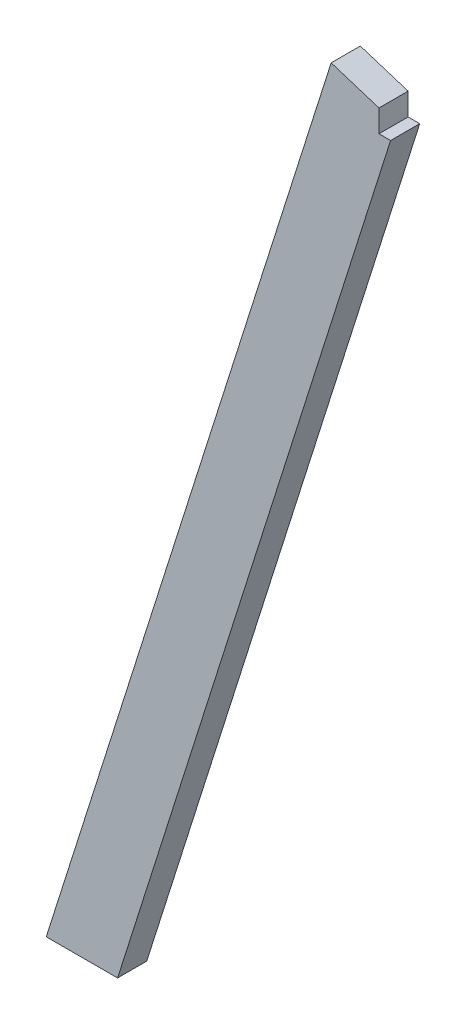
ISO-10303-21;
HEADER;
FILE_DESCRIPTION(('STEP AP214'),'2;1');
FILE_NAME('part.step','',(''),(''),'','','');
FILE_SCHEMA(('AUTOMOTIVE_DESIGN { 1 0 10303 214 1 1 1 1 }'));
ENDSEC;
DATA;
#1=APPLICATION_CONTEXT('core data for automotive mechanical design processes');
#2=APPLICATION_PROTOCOL_DEFINITION('international standard','automotive_design',2000,#1);
#3=PRODUCT_CONTEXT('',#1,'mechanical');
#4=PRODUCT('Part','Part','',(#3));
#5=PRODUCT_RELATED_PRODUCT_CATEGORY('part','',(#4));
#6=PRODUCT_DEFINITION_FORMATION('','',#4);
#7=PRODUCT_DEFINITION_CONTEXT('part definition',#1,'design');
#8=PRODUCT_DEFINITION('design','',#6,#7);
#9=PRODUCT_DEFINITION_SHAPE('','',#8);
#10=(LENGTH_UNIT() NAMED_UNIT(*) SI_UNIT(.MILLI.,.METRE.));
#11=(NAMED_UNIT(*) PLANE_ANGLE_UNIT() SI_UNIT($,.RADIAN.));
#12=(NAMED_UNIT(*) SI_UNIT($,.STERADIAN.) SOLID_ANGLE_UNIT());
#13=UNCERTAINTY_MEASURE_WITH_UNIT(LENGTH_MEASURE(1.E-05),#10,'distance_accuracy_value','');
#14=(GEOMETRIC_REPRESENTATION_CONTEXT(3) GLOBAL_UNCERTAINTY_ASSIGNED_CONTEXT((#13)) GLOBAL_UNIT_ASSIGNED_CONTEXT((#10,
#11,#12)) REPRESENTATION_CONTEXT('',''));
#15=CARTESIAN_POINT('',(0.,0.,0.));
#16=DIRECTION('',(0.,0.,1.));
#17=DIRECTION('',(1.,0.,0.));
#18=AXIS2_PLACEMENT_3D('',#15,#16,#17);
#19=CARTESIAN_POINT('',(0.,0.,38.1));
#20=DIRECTION('',(0.953307939110766,-0.301999955676131,0.));
#21=DIRECTION('',(0.301999955676131,0.953307939110765,0.));
#22=AXIS2_PLACEMENT_3D('',#19,#20,#21);
#23=PLANE('',#22);
#24=DIRECTION('',(-0.301999955676131,-0.953307939110765,0.));
#25=VECTOR('',#24,1.);
#26=CARTESIAN_POINT('',(0.,0.,0.));
#27=LINE('',#26,#25);
#28=CARTESIAN_POINT('',(372.450924213053,1175.69693739365,0.));
#29=VERTEX_POINT('',#28);
#30=CARTESIAN_POINT('',(0.,0.,0.));
#31=VERTEX_POINT('',#30);
#32=EDGE_CURVE('E117',#29,#31,#27,.T.);
#33=ORIENTED_EDGE('',*,*,#32,.T.);
#34=DIRECTION('',(0.,0.,-1.));
#35=VECTOR('',#34,1.);
#36=CARTESIAN_POINT('',(0.,0.,38.1));
#37=LINE('',#36,#35);
#38=CARTESIAN_POINT('',(0.,0.,38.1));
#39=VERTEX_POINT('',#38);
#40=EDGE_CURVE('E11',#39,#31,#37,.T.);
#41=ORIENTED_EDGE('',*,*,#40,.F.);
#42=DIRECTION('',(-0.301999955676131,-0.953307939110765,0.));
#43=VECTOR('',#42,1.);
#44=CARTESIAN_POINT('',(0.,0.,38.1));
#45=LINE('',#44,#43);
#46=CARTESIAN_POINT('',(372.450924213053,1175.69693739365,38.1));
#47=VERTEX_POINT('',#46);
#48=EDGE_CURVE('E119',#47,#39,#45,.T.);
#49=ORIENTED_EDGE('',*,*,#48,.F.);
#50=DIRECTION('',(0.,0.,-1.));
#51=VECTOR('',#50,1.);
#52=CARTESIAN_POINT('',(372.450924213053,1175.69693739365,38.1));
#53=LINE('',#52,#51);
#54=EDGE_CURVE('E126',#47,#29,#53,.T.);
#55=ORIENTED_EDGE('',*,*,#54,.T.);
#56=EDGE_LOOP('',(#33,#41,#49,#55));
#57=FACE_BOUND('',#56,.T.);
#58=ADVANCED_FACE('F33',(#57),#23,.F.);
#59=CARTESIAN_POINT('',(0.,0.,38.1));
#60=DIRECTION('',(0.,1.,0.));
#61=DIRECTION('',(0.,0.,1.));
#62=AXIS2_PLACEMENT_3D('',#59,#60,#61);
#63=PLANE('',#62);
#64=DIRECTION('',(1.,0.,0.));
#65=VECTOR('',#64,1.);
#66=CARTESIAN_POINT('',(0.,0.,0.));
#67=LINE('',#66,#65);
#68=CARTESIAN_POINT('',(93.2542322923745,0.,0.));
#69=VERTEX_POINT('',#68);
#70=EDGE_CURVE('E129',#31,#69,#67,.T.);
#71=ORIENTED_EDGE('',*,*,#70,.T.);
#72=DIRECTION('',(0.,0.,-1.));
#73=VECTOR('',#72,1.);
#74=CARTESIAN_POINT('',(93.2542322923745,0.,38.1));
#75=LINE('',#74,#73);
#76=CARTESIAN_POINT('',(93.2542322923745,0.,38.1));
#77=VERTEX_POINT('',#76);
#78=EDGE_CURVE('E40',#77,#69,#75,.T.);
#79=ORIENTED_EDGE('',*,*,#78,.F.);
#80=DIRECTION('',(1.,0.,0.));
#81=VECTOR('',#80,1.);
#82=CARTESIAN_POINT('',(0.,0.,38.1));
#83=LINE('',#82,#81);
#84=EDGE_CURVE('E79',#39,#77,#83,.T.);
#85=ORIENTED_EDGE('',*,*,#84,.F.);
#86=ORIENTED_EDGE('',*,*,#40,.T.);
#87=EDGE_LOOP('',(#71,#79,#85,#86));
#88=FACE_BOUND('',#87,.T.);
#89=ADVANCED_FACE('F139',(#88),#63,.F.);
#90=CARTESIAN_POINT('',(93.2542322923745,0.,38.1));
#91=DIRECTION('',(-0.953307939110766,0.301999955676131,0.));
#92=DIRECTION('',(-0.301999955676131,-0.953307939110766,0.));
#93=AXIS2_PLACEMENT_3D('',#90,#91,#92);
#94=PLANE('',#93);
#95=DIRECTION('',(0.301999955676131,0.953307939110766,0.));
#96=VECTOR('',#95,1.);
#97=CARTESIAN_POINT('',(93.2542322923745,0.,0.));
#98=LINE('',#97,#96);
#99=CARTESIAN_POINT('',(450.159306495273,1126.62414133404,0.));
#100=VERTEX_POINT('',#99);
#101=EDGE_CURVE('E131',#69,#100,#98,.T.);
#102=ORIENTED_EDGE('',*,*,#101,.T.);
#103=DIRECTION('',(0.,0.,1.));
#104=VECTOR('',#103,1.);
#105=CARTESIAN_POINT('',(450.159306495273,1126.62414133404,0.));
#106=LINE('',#105,#104);
#107=CARTESIAN_POINT('',(450.159306495273,1126.62414133404,38.1));
#108=VERTEX_POINT('',#107);
#109=EDGE_CURVE('E47',#100,#108,#106,.T.);
#110=ORIENTED_EDGE('',*,*,#109,.T.);
#111=DIRECTION('',(0.301999955676131,0.953307939110766,0.));
#112=VECTOR('',#111,1.);
#113=CARTESIAN_POINT('',(93.2542322923745,0.,38.1));
#114=LINE('',#113,#112);
#115=EDGE_CURVE('E122',#77,#108,#114,.T.);
#116=ORIENTED_EDGE('',*,*,#115,.F.);
#117=ORIENTED_EDGE('',*,*,#78,.T.);
#118=EDGE_LOOP('',(#102,#110,#116,#117));
#119=FACE_BOUND('',#118,.T.);
#120=ADVANCED_FACE('F137',(#119),#94,.F.);
#121=CARTESIAN_POINT('',(457.2,1148.84914133404,38.1));
#122=DIRECTION('',(-0.301999955676131,-0.953307939110766,0.));
#123=DIRECTION('',(0.953307939110765,-0.301999955676131,0.));
#124=AXIS2_PLACEMENT_3D('',#121,#122,#123);
#125=PLANE('',#124);
#126=DIRECTION('',(-0.953307939110765,0.301999955676131,0.));
#127=VECTOR('',#126,1.);
#128=CARTESIAN_POINT('',(457.2,1148.84914133404,38.1));
#129=LINE('',#128,#127);
#130=CARTESIAN_POINT('',(434.975,1155.88983483877,38.1));
#131=VERTEX_POINT('',#130);
#132=EDGE_CURVE('E56',#131,#47,#129,.T.);
#133=ORIENTED_EDGE('',*,*,#132,.F.);
#134=DIRECTION('',(0.,0.,1.));
#135=VECTOR('',#134,1.);
#136=CARTESIAN_POINT('',(434.975,1155.88983483877,0.));
#137=LINE('',#136,#135);
#138=CARTESIAN_POINT('',(434.975,1155.88983483877,0.));
#139=VERTEX_POINT('',#138);
#140=EDGE_CURVE('E115',#139,#131,#137,.T.);
#141=ORIENTED_EDGE('',*,*,#140,.F.);
#142=DIRECTION('',(-0.953307939110765,0.301999955676131,0.));
#143=VECTOR('',#142,1.);
#144=CARTESIAN_POINT('',(457.2,1148.84914133404,0.));
#145=LINE('',#144,#143);
#146=EDGE_CURVE('E74',#139,#29,#145,.T.);
#147=ORIENTED_EDGE('',*,*,#146,.T.);
#148=ORIENTED_EDGE('',*,*,#54,.F.);
#149=EDGE_LOOP('',(#133,#141,#147,#148));
#150=FACE_BOUND('',#149,.T.);
#151=ADVANCED_FACE('F142',(#150),#125,.F.);
#152=CARTESIAN_POINT('',(0.,0.,38.1));
#153=DIRECTION('',(0.,0.,1.));
#154=DIRECTION('',(1.,0.,0.));
#155=AXIS2_PLACEMENT_3D('',#152,#153,#154);
#156=PLANE('',#155);
#157=DIRECTION('',(0.,-1.,0.));
#158=VECTOR('',#157,1.);
#159=CARTESIAN_POINT('',(434.975,0.,38.1));
#160=LINE('',#159,#158);
#161=CARTESIAN_POINT('',(434.975,1126.62414133404,38.1));
#162=VERTEX_POINT('',#161);
#163=EDGE_CURVE('E99',#131,#162,#160,.T.);
#164=ORIENTED_EDGE('',*,*,#163,.F.);
#165=ORIENTED_EDGE('',*,*,#132,.T.);
#166=ORIENTED_EDGE('',*,*,#48,.T.);
#167=ORIENTED_EDGE('',*,*,#84,.T.);
#168=ORIENTED_EDGE('',*,*,#115,.T.);
#169=DIRECTION('',(1.,0.,0.));
#170=VECTOR('',#169,1.);
#171=CARTESIAN_POINT('',(0.,1126.62414133404,38.1));
#172=LINE('',#171,#170);
#173=EDGE_CURVE('E110',#162,#108,#172,.T.);
#174=ORIENTED_EDGE('',*,*,#173,.F.);
#175=EDGE_LOOP('',(#164,#165,#166,#167,#168,#174));
#176=FACE_BOUND('',#175,.T.);
#177=ADVANCED_FACE('F143',(#176),#156,.T.);
#178=CARTESIAN_POINT('',(0.,0.,0.));
#179=DIRECTION('',(0.,0.,1.));
#180=DIRECTION('',(1.,0.,0.));
#181=AXIS2_PLACEMENT_3D('',#178,#179,#180);
#182=PLANE('',#181);
#183=ORIENTED_EDGE('',*,*,#146,.F.);
#184=DIRECTION('',(0.,-1.,0.));
#185=VECTOR('',#184,1.);
#186=CARTESIAN_POINT('',(434.975,0.,0.));
#187=LINE('',#186,#185);
#188=CARTESIAN_POINT('',(434.975,1126.62414133404,0.));
#189=VERTEX_POINT('',#188);
#190=EDGE_CURVE('E98',#139,#189,#187,.T.);
#191=ORIENTED_EDGE('',*,*,#190,.T.);
#192=DIRECTION('',(1.,0.,0.));
#193=VECTOR('',#192,1.);
#194=CARTESIAN_POINT('',(0.,1126.62414133404,0.));
#195=LINE('',#194,#193);
#196=EDGE_CURVE('E101',#189,#100,#195,.T.);
#197=ORIENTED_EDGE('',*,*,#196,.T.);
#198=ORIENTED_EDGE('',*,*,#101,.F.);
#199=ORIENTED_EDGE('',*,*,#70,.F.);
#200=ORIENTED_EDGE('',*,*,#32,.F.);
#201=EDGE_LOOP('',(#183,#191,#197,#198,#199,#200));
#202=FACE_BOUND('',#201,.T.);
#203=ADVANCED_FACE('F108',(#202),#182,.F.);
#204=CARTESIAN_POINT('',(434.975,0.,0.));
#205=DIRECTION('',(-1.,0.,0.));
#206=DIRECTION('',(0.,0.,1.));
#207=AXIS2_PLACEMENT_3D('',#204,#205,#206);
#208=PLANE('',#207);
#209=ORIENTED_EDGE('',*,*,#163,.T.);
#210=DIRECTION('',(0.,0.,1.));
#211=VECTOR('',#210,1.);
#212=CARTESIAN_POINT('',(434.975,1126.62414133404,0.));
#213=LINE('',#212,#211);
#214=EDGE_CURVE('E95',#189,#162,#213,.T.);
#215=ORIENTED_EDGE('',*,*,#214,.F.);
#216=ORIENTED_EDGE('',*,*,#190,.F.);
#217=ORIENTED_EDGE('',*,*,#140,.T.);
#218=EDGE_LOOP('',(#209,#215,#216,#217));
#219=FACE_BOUND('',#218,.T.);
#220=ADVANCED_FACE('F96',(#219),#208,.F.);
#221=CARTESIAN_POINT('',(0.,1126.62414133404,0.));
#222=DIRECTION('',(0.,-1.,0.));
#223=DIRECTION('',(0.,0.,-1.));
#224=AXIS2_PLACEMENT_3D('',#221,#222,#223);
#225=PLANE('',#224);
#226=ORIENTED_EDGE('',*,*,#173,.T.);
#227=ORIENTED_EDGE('',*,*,#109,.F.);
#228=ORIENTED_EDGE('',*,*,#196,.F.);
#229=ORIENTED_EDGE('',*,*,#214,.T.);
#230=EDGE_LOOP('',(#226,#227,#228,#229));
#231=FACE_BOUND('',#230,.T.);
#232=ADVANCED_FACE('F103',(#231),#225,.F.);
#233=CLOSED_SHELL('',(#58,#89,#120,#151,#177,#203,#220,#232));
#234=MANIFOLD_SOLID_BREP('B2',#233);
#235=ADVANCED_BREP_SHAPE_REPRESENTATION('',(#18,#234),#14);
#236=SHAPE_DEFINITION_REPRESENTATION(#9,#235);
ENDSEC;
END-ISO-10303-21;
